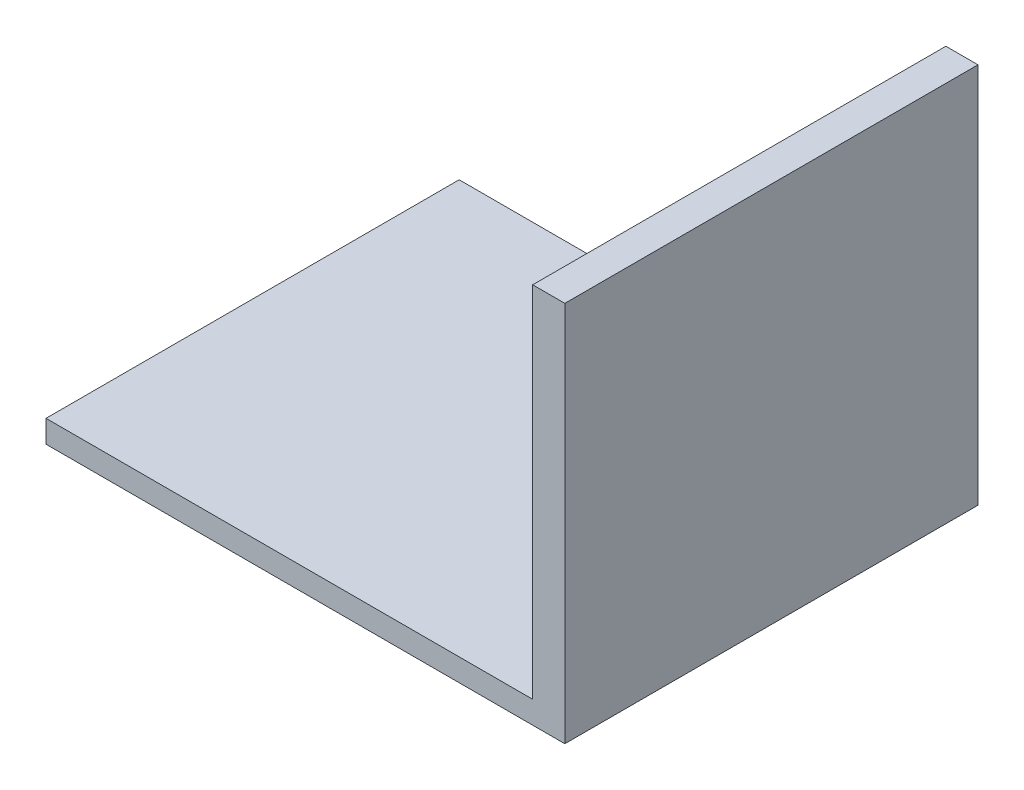
ISO-10303-21;
HEADER;
FILE_DESCRIPTION(('STEP AP214'),'2;1');
FILE_NAME('part.step','',(''),(''),'','','');
FILE_SCHEMA(('AUTOMOTIVE_DESIGN { 1 0 10303 214 1 1 1 1 }'));
ENDSEC;
DATA;
#1=APPLICATION_CONTEXT('core data for automotive mechanical design processes');
#2=APPLICATION_PROTOCOL_DEFINITION('international standard','automotive_design',2000,#1);
#3=PRODUCT_CONTEXT('',#1,'mechanical');
#4=PRODUCT('Part','Part','',(#3));
#5=PRODUCT_RELATED_PRODUCT_CATEGORY('part','',(#4));
#6=PRODUCT_DEFINITION_FORMATION('','',#4);
#7=PRODUCT_DEFINITION_CONTEXT('part definition',#1,'design');
#8=PRODUCT_DEFINITION('design','',#6,#7);
#9=PRODUCT_DEFINITION_SHAPE('','',#8);
#10=(LENGTH_UNIT() NAMED_UNIT(*) SI_UNIT(.MILLI.,.METRE.));
#11=(NAMED_UNIT(*) PLANE_ANGLE_UNIT() SI_UNIT($,.RADIAN.));
#12=(NAMED_UNIT(*) SI_UNIT($,.STERADIAN.) SOLID_ANGLE_UNIT());
#13=UNCERTAINTY_MEASURE_WITH_UNIT(LENGTH_MEASURE(1.E-05),#10,'distance_accuracy_value','');
#14=(GEOMETRIC_REPRESENTATION_CONTEXT(3) GLOBAL_UNCERTAINTY_ASSIGNED_CONTEXT((#13)) GLOBAL_UNIT_ASSIGNED_CONTEXT((#10,
#11,#12)) REPRESENTATION_CONTEXT('',''));
#15=CARTESIAN_POINT('',(0.,0.,0.));
#16=DIRECTION('',(0.,0.,1.));
#17=DIRECTION('',(1.,0.,0.));
#18=AXIS2_PLACEMENT_3D('',#15,#16,#17);
#19=CARTESIAN_POINT('',(-40.3323535464941,4.,-34.672058238389));
#20=DIRECTION('',(1.,0.,0.));
#21=DIRECTION('',(0.,0.,-1.));
#22=AXIS2_PLACEMENT_3D('',#19,#20,#21);
#23=PLANE('',#22);
#24=DIRECTION('',(0.,0.,1.));
#25=VECTOR('',#24,1.);
#26=CARTESIAN_POINT('',(-40.3323535464941,0.,-34.672058238389));
#27=LINE('',#26,#25);
#28=CARTESIAN_POINT('',(-40.3323535464941,0.,-34.672058238389));
#29=VERTEX_POINT('',#28);
#30=CARTESIAN_POINT('',(-40.3323535464941,0.,38.987941761611));
#31=VERTEX_POINT('',#30);
#32=EDGE_CURVE('E89',#29,#31,#27,.T.);
#33=ORIENTED_EDGE('',*,*,#32,.T.);
#34=DIRECTION('',(0.,-1.,0.));
#35=VECTOR('',#34,1.);
#36=CARTESIAN_POINT('',(-40.3323535464941,4.,38.987941761611));
#37=LINE('',#36,#35);
#38=CARTESIAN_POINT('',(-40.3323535464941,4.,38.987941761611));
#39=VERTEX_POINT('',#38);
#40=EDGE_CURVE('E11',#39,#31,#37,.T.);
#41=ORIENTED_EDGE('',*,*,#40,.F.);
#42=DIRECTION('',(0.,0.,1.));
#43=VECTOR('',#42,1.);
#44=CARTESIAN_POINT('',(-40.3323535464941,4.,-34.672058238389));
#45=LINE('',#44,#43);
#46=CARTESIAN_POINT('',(-40.3323535464941,4.,-34.672058238389));
#47=VERTEX_POINT('',#46);
#48=EDGE_CURVE('E83',#47,#39,#45,.T.);
#49=ORIENTED_EDGE('',*,*,#48,.F.);
#50=DIRECTION('',(0.,-1.,0.));
#51=VECTOR('',#50,1.);
#52=CARTESIAN_POINT('',(-40.3323535464941,4.,-34.672058238389));
#53=LINE('',#52,#51);
#54=EDGE_CURVE('E75',#47,#29,#53,.T.);
#55=ORIENTED_EDGE('',*,*,#54,.T.);
#56=EDGE_LOOP('',(#33,#41,#49,#55));
#57=FACE_BOUND('',#56,.T.);
#58=ADVANCED_FACE('F33',(#57),#23,.F.);
#59=CARTESIAN_POINT('',(-40.3323535464941,4.,38.987941761611));
#60=DIRECTION('',(0.,0.,-1.));
#61=DIRECTION('',(-1.,0.,0.));
#62=AXIS2_PLACEMENT_3D('',#59,#60,#61);
#63=PLANE('',#62);
#64=DIRECTION('',(1.,0.,0.));
#65=VECTOR('',#64,1.);
#66=CARTESIAN_POINT('',(-40.3323535464941,0.,38.987941761611));
#67=LINE('',#66,#65);
#68=CARTESIAN_POINT('',(52.1631772534658,0.,38.987941761611));
#69=VERTEX_POINT('',#68);
#70=EDGE_CURVE('E92',#31,#69,#67,.T.);
#71=ORIENTED_EDGE('',*,*,#70,.T.);
#72=DIRECTION('',(0.,-1.,0.));
#73=VECTOR('',#72,1.);
#74=CARTESIAN_POINT('',(52.1631772534658,4.,38.987941761611));
#75=LINE('',#74,#73);
#76=CARTESIAN_POINT('',(52.1631772534658,68.,38.987941761611));
#77=VERTEX_POINT('',#76);
#78=EDGE_CURVE('E40',#77,#69,#75,.T.);
#79=ORIENTED_EDGE('',*,*,#78,.F.);
#80=DIRECTION('',(1.,0.,0.));
#81=VECTOR('',#80,1.);
#82=CARTESIAN_POINT('',(52.1631772534658,68.,38.987941761611));
#83=LINE('',#82,#81);
#84=CARTESIAN_POINT('',(46.434441845804,68.,38.987941761611));
#85=VERTEX_POINT('',#84);
#86=EDGE_CURVE('E116',#85,#77,#83,.T.);
#87=ORIENTED_EDGE('',*,*,#86,.F.);
#88=DIRECTION('',(0.,-1.,0.));
#89=VECTOR('',#88,1.);
#90=CARTESIAN_POINT('',(46.434441845804,68.,38.987941761611));
#91=LINE('',#90,#89);
#92=CARTESIAN_POINT('',(46.434441845804,4.,38.987941761611));
#93=VERTEX_POINT('',#92);
#94=EDGE_CURVE('E97',#85,#93,#91,.T.);
#95=ORIENTED_EDGE('',*,*,#94,.T.);
#96=DIRECTION('',(1.,0.,0.));
#97=VECTOR('',#96,1.);
#98=CARTESIAN_POINT('',(-40.3323535464941,4.,38.987941761611));
#99=LINE('',#98,#97);
#100=EDGE_CURVE('E133',#39,#93,#99,.T.);
#101=ORIENTED_EDGE('',*,*,#100,.F.);
#102=ORIENTED_EDGE('',*,*,#40,.T.);
#103=EDGE_LOOP('',(#71,#79,#87,#95,#101,#102));
#104=FACE_BOUND('',#103,.T.);
#105=ADVANCED_FACE('F113',(#104),#63,.F.);
#106=CARTESIAN_POINT('',(52.1631772534658,4.,-34.672058238389));
#107=DIRECTION('',(-1.,0.,0.));
#108=DIRECTION('',(0.,0.,1.));
#109=AXIS2_PLACEMENT_3D('',#106,#107,#108);
#110=PLANE('',#109);
#111=DIRECTION('',(0.,0.,-1.));
#112=VECTOR('',#111,1.);
#113=CARTESIAN_POINT('',(52.1631772534658,0.,-34.672058238389));
#114=LINE('',#113,#112);
#115=CARTESIAN_POINT('',(52.1631772534658,0.,-34.672058238389));
#116=VERTEX_POINT('',#115);
#117=EDGE_CURVE('E84',#69,#116,#114,.T.);
#118=ORIENTED_EDGE('',*,*,#117,.T.);
#119=DIRECTION('',(0.,-1.,0.));
#120=VECTOR('',#119,1.);
#121=CARTESIAN_POINT('',(52.1631772534658,4.,-34.672058238389));
#122=LINE('',#121,#120);
#123=CARTESIAN_POINT('',(52.1631772534658,68.,-34.672058238389));
#124=VERTEX_POINT('',#123);
#125=EDGE_CURVE('E79',#124,#116,#122,.T.);
#126=ORIENTED_EDGE('',*,*,#125,.F.);
#127=DIRECTION('',(0.,0.,-1.));
#128=VECTOR('',#127,1.);
#129=CARTESIAN_POINT('',(52.1631772534658,68.,-34.672058238389));
#130=LINE('',#129,#128);
#131=EDGE_CURVE('E109',#77,#124,#130,.T.);
#132=ORIENTED_EDGE('',*,*,#131,.F.);
#133=ORIENTED_EDGE('',*,*,#78,.T.);
#134=EDGE_LOOP('',(#118,#126,#132,#133));
#135=FACE_BOUND('',#134,.T.);
#136=ADVANCED_FACE('F107',(#135),#110,.F.);
#137=CARTESIAN_POINT('',(-40.3323535464941,4.,-34.672058238389));
#138=DIRECTION('',(0.,0.,1.));
#139=DIRECTION('',(1.,0.,0.));
#140=AXIS2_PLACEMENT_3D('',#137,#138,#139);
#141=PLANE('',#140);
#142=DIRECTION('',(-1.,0.,0.));
#143=VECTOR('',#142,1.);
#144=CARTESIAN_POINT('',(-40.3323535464941,0.,-34.672058238389));
#145=LINE('',#144,#143);
#146=EDGE_CURVE('E72',#116,#29,#145,.T.);
#147=ORIENTED_EDGE('',*,*,#146,.T.);
#148=ORIENTED_EDGE('',*,*,#54,.F.);
#149=DIRECTION('',(-1.,0.,0.));
#150=VECTOR('',#149,1.);
#151=CARTESIAN_POINT('',(-40.3323535464941,4.,-34.672058238389));
#152=LINE('',#151,#150);
#153=CARTESIAN_POINT('',(46.434441845804,4.,-34.672058238389));
#154=VERTEX_POINT('',#153);
#155=EDGE_CURVE('E52',#154,#47,#152,.T.);
#156=ORIENTED_EDGE('',*,*,#155,.F.);
#157=DIRECTION('',(0.,-1.,0.));
#158=VECTOR('',#157,1.);
#159=CARTESIAN_POINT('',(46.434441845804,68.,-34.672058238389));
#160=LINE('',#159,#158);
#161=CARTESIAN_POINT('',(46.434441845804,68.,-34.672058238389));
#162=VERTEX_POINT('',#161);
#163=EDGE_CURVE('E93',#162,#154,#160,.T.);
#164=ORIENTED_EDGE('',*,*,#163,.F.);
#165=DIRECTION('',(-1.,0.,0.));
#166=VECTOR('',#165,1.);
#167=CARTESIAN_POINT('',(52.1631772534658,68.,-34.672058238389));
#168=LINE('',#167,#166);
#169=EDGE_CURVE('E128',#124,#162,#168,.T.);
#170=ORIENTED_EDGE('',*,*,#169,.F.);
#171=ORIENTED_EDGE('',*,*,#125,.T.);
#172=EDGE_LOOP('',(#147,#148,#156,#164,#170,#171));
#173=FACE_BOUND('',#172,.T.);
#174=ADVANCED_FACE('F74',(#173),#141,.F.);
#175=CARTESIAN_POINT('',(0.,4.,0.));
#176=DIRECTION('',(0.,1.,0.));
#177=DIRECTION('',(0.,0.,1.));
#178=AXIS2_PLACEMENT_3D('',#175,#176,#177);
#179=PLANE('',#178);
#180=DIRECTION('',(0.,0.,1.));
#181=VECTOR('',#180,1.);
#182=CARTESIAN_POINT('',(46.434441845804,4.,-34.672058238389));
#183=LINE('',#182,#181);
#184=EDGE_CURVE('E47',#154,#93,#183,.T.);
#185=ORIENTED_EDGE('',*,*,#184,.F.);
#186=ORIENTED_EDGE('',*,*,#155,.T.);
#187=ORIENTED_EDGE('',*,*,#48,.T.);
#188=ORIENTED_EDGE('',*,*,#100,.T.);
#189=EDGE_LOOP('',(#185,#186,#187,#188));
#190=FACE_BOUND('',#189,.T.);
#191=ADVANCED_FACE('F135',(#190),#179,.T.);
#192=CARTESIAN_POINT('',(0.,0.,0.));
#193=DIRECTION('',(0.,1.,0.));
#194=DIRECTION('',(0.,0.,1.));
#195=AXIS2_PLACEMENT_3D('',#192,#193,#194);
#196=PLANE('',#195);
#197=ORIENTED_EDGE('',*,*,#32,.F.);
#198=ORIENTED_EDGE('',*,*,#146,.F.);
#199=ORIENTED_EDGE('',*,*,#117,.F.);
#200=ORIENTED_EDGE('',*,*,#70,.F.);
#201=EDGE_LOOP('',(#197,#198,#199,#200));
#202=FACE_BOUND('',#201,.T.);
#203=ADVANCED_FACE('F91',(#202),#196,.F.);
#204=CARTESIAN_POINT('',(46.434441845804,68.,-34.672058238389));
#205=DIRECTION('',(1.,0.,0.));
#206=DIRECTION('',(0.,0.,-1.));
#207=AXIS2_PLACEMENT_3D('',#204,#205,#206);
#208=PLANE('',#207);
#209=ORIENTED_EDGE('',*,*,#184,.T.);
#210=ORIENTED_EDGE('',*,*,#94,.F.);
#211=DIRECTION('',(0.,0.,1.));
#212=VECTOR('',#211,1.);
#213=CARTESIAN_POINT('',(46.434441845804,68.,-34.672058238389));
#214=LINE('',#213,#212);
#215=EDGE_CURVE('E124',#162,#85,#214,.T.);
#216=ORIENTED_EDGE('',*,*,#215,.F.);
#217=ORIENTED_EDGE('',*,*,#163,.T.);
#218=EDGE_LOOP('',(#209,#210,#216,#217));
#219=FACE_BOUND('',#218,.T.);
#220=ADVANCED_FACE('F137',(#219),#208,.F.);
#221=CARTESIAN_POINT('',(0.,68.,0.));
#222=DIRECTION('',(0.,-1.,0.));
#223=DIRECTION('',(0.,0.,-1.));
#224=AXIS2_PLACEMENT_3D('',#221,#222,#223);
#225=PLANE('',#224);
#226=ORIENTED_EDGE('',*,*,#131,.T.);
#227=ORIENTED_EDGE('',*,*,#169,.T.);
#228=ORIENTED_EDGE('',*,*,#215,.T.);
#229=ORIENTED_EDGE('',*,*,#86,.T.);
#230=EDGE_LOOP('',(#226,#227,#228,#229));
#231=FACE_BOUND('',#230,.T.);
#232=ADVANCED_FACE('F120',(#231),#225,.F.);
#233=CLOSED_SHELL('',(#58,#105,#136,#174,#191,#203,#220,#232));
#234=MANIFOLD_SOLID_BREP('B2',#233);
#235=ADVANCED_BREP_SHAPE_REPRESENTATION('',(#18,#234),#14);
#236=SHAPE_DEFINITION_REPRESENTATION(#9,#235);
ENDSEC;
END-ISO-10303-21;
